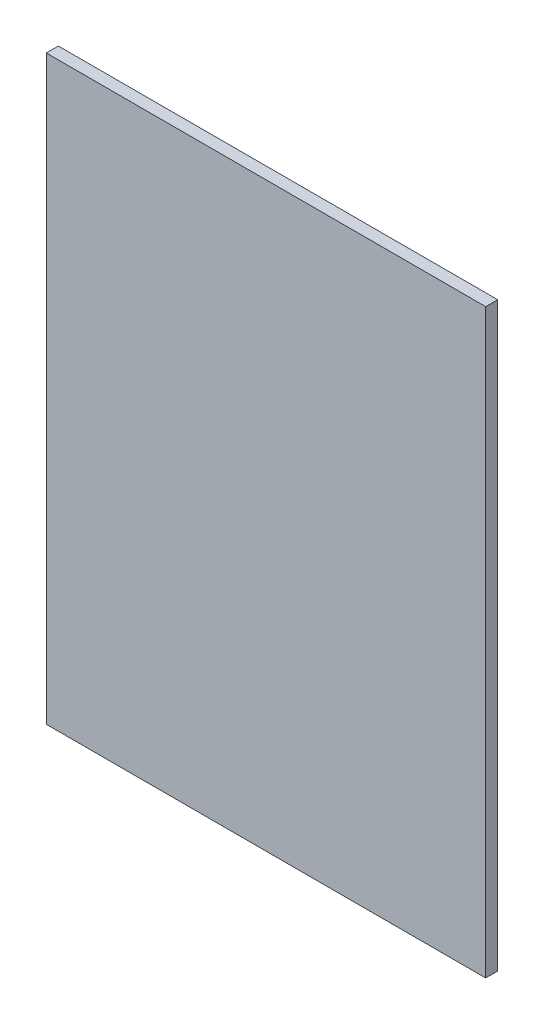
ISO-10303-21;
HEADER;
FILE_DESCRIPTION(('STEP AP214'),'2;1');
FILE_NAME('part.step','',(''),(''),'','','');
FILE_SCHEMA(('AUTOMOTIVE_DESIGN { 1 0 10303 214 1 1 1 1 }'));
ENDSEC;
DATA;
#1=APPLICATION_CONTEXT('core data for automotive mechanical design processes');
#2=APPLICATION_PROTOCOL_DEFINITION('international standard','automotive_design',2000,#1);
#3=PRODUCT_CONTEXT('',#1,'mechanical');
#4=PRODUCT('Part','Part','',(#3));
#5=PRODUCT_RELATED_PRODUCT_CATEGORY('part','',(#4));
#6=PRODUCT_DEFINITION_FORMATION('','',#4);
#7=PRODUCT_DEFINITION_CONTEXT('part definition',#1,'design');
#8=PRODUCT_DEFINITION('design','',#6,#7);
#9=PRODUCT_DEFINITION_SHAPE('','',#8);
#10=(LENGTH_UNIT() NAMED_UNIT(*) SI_UNIT(.MILLI.,.METRE.));
#11=(NAMED_UNIT(*) PLANE_ANGLE_UNIT() SI_UNIT($,.RADIAN.));
#12=(NAMED_UNIT(*) SI_UNIT($,.STERADIAN.) SOLID_ANGLE_UNIT());
#13=UNCERTAINTY_MEASURE_WITH_UNIT(LENGTH_MEASURE(1.E-05),#10,'distance_accuracy_value','');
#14=(GEOMETRIC_REPRESENTATION_CONTEXT(3) GLOBAL_UNCERTAINTY_ASSIGNED_CONTEXT((#13)) GLOBAL_UNIT_ASSIGNED_CONTEXT((#10,
#11,#12)) REPRESENTATION_CONTEXT('',''));
#15=CARTESIAN_POINT('',(0.,0.,0.));
#16=DIRECTION('',(0.,0.,1.));
#17=DIRECTION('',(1.,0.,0.));
#18=AXIS2_PLACEMENT_3D('',#15,#16,#17);
#19=CARTESIAN_POINT('',(0.,0.,3.));
#20=DIRECTION('',(1.,0.,0.));
#21=DIRECTION('',(0.,0.,-1.));
#22=AXIS2_PLACEMENT_3D('',#19,#20,#21);
#23=PLANE('',#22);
#24=DIRECTION('',(0.,-1.,0.));
#25=VECTOR('',#24,1.);
#26=CARTESIAN_POINT('',(0.,0.,0.));
#27=LINE('',#26,#25);
#28=CARTESIAN_POINT('',(0.,0.,0.));
#29=VERTEX_POINT('',#28);
#30=CARTESIAN_POINT('',(0.,-145.,0.));
#31=VERTEX_POINT('',#30);
#32=EDGE_CURVE('E107',#29,#31,#27,.T.);
#33=ORIENTED_EDGE('',*,*,#32,.T.);
#34=DIRECTION('',(0.,0.,-1.));
#35=VECTOR('',#34,1.);
#36=CARTESIAN_POINT('',(0.,-145.,3.));
#37=LINE('',#36,#35);
#38=CARTESIAN_POINT('',(0.,-145.,3.));
#39=VERTEX_POINT('',#38);
#40=EDGE_CURVE('E11',#39,#31,#37,.T.);
#41=ORIENTED_EDGE('',*,*,#40,.F.);
#42=DIRECTION('',(0.,-1.,0.));
#43=VECTOR('',#42,1.);
#44=CARTESIAN_POINT('',(0.,0.,3.));
#45=LINE('',#44,#43);
#46=CARTESIAN_POINT('',(0.,0.,3.));
#47=VERTEX_POINT('',#46);
#48=EDGE_CURVE('E91',#47,#39,#45,.T.);
#49=ORIENTED_EDGE('',*,*,#48,.F.);
#50=DIRECTION('',(0.,0.,-1.));
#51=VECTOR('',#50,1.);
#52=CARTESIAN_POINT('',(0.,0.,3.));
#53=LINE('',#52,#51);
#54=EDGE_CURVE('E103',#47,#29,#53,.T.);
#55=ORIENTED_EDGE('',*,*,#54,.T.);
#56=EDGE_LOOP('',(#33,#41,#49,#55));
#57=FACE_BOUND('',#56,.T.);
#58=ADVANCED_FACE('F39',(#57),#23,.F.);
#59=CARTESIAN_POINT('',(0.,-145.,3.));
#60=DIRECTION('',(0.,1.,0.));
#61=DIRECTION('',(0.,0.,1.));
#62=AXIS2_PLACEMENT_3D('',#59,#60,#61);
#63=PLANE('',#62);
#64=DIRECTION('',(1.,0.,0.));
#65=VECTOR('',#64,1.);
#66=CARTESIAN_POINT('',(0.,-145.,0.));
#67=LINE('',#66,#65);
#68=CARTESIAN_POINT('',(109.6,-145.,0.));
#69=VERTEX_POINT('',#68);
#70=EDGE_CURVE('E96',#31,#69,#67,.T.);
#71=ORIENTED_EDGE('',*,*,#70,.T.);
#72=DIRECTION('',(0.,0.,-1.));
#73=VECTOR('',#72,1.);
#74=CARTESIAN_POINT('',(109.6,-145.,3.));
#75=LINE('',#74,#73);
#76=CARTESIAN_POINT('',(109.6,-145.,3.));
#77=VERTEX_POINT('',#76);
#78=EDGE_CURVE('E48',#77,#69,#75,.T.);
#79=ORIENTED_EDGE('',*,*,#78,.F.);
#80=DIRECTION('',(1.,0.,0.));
#81=VECTOR('',#80,1.);
#82=CARTESIAN_POINT('',(0.,-145.,3.));
#83=LINE('',#82,#81);
#84=EDGE_CURVE('E86',#39,#77,#83,.T.);
#85=ORIENTED_EDGE('',*,*,#84,.F.);
#86=ORIENTED_EDGE('',*,*,#40,.T.);
#87=EDGE_LOOP('',(#71,#79,#85,#86));
#88=FACE_BOUND('',#87,.T.);
#89=ADVANCED_FACE('F95',(#88),#63,.F.);
#90=CARTESIAN_POINT('',(109.6,0.,3.));
#91=DIRECTION('',(-1.,0.,0.));
#92=DIRECTION('',(0.,-1.,0.));
#93=AXIS2_PLACEMENT_3D('',#90,#91,#92);
#94=PLANE('',#93);
#95=DIRECTION('',(0.,1.,0.));
#96=VECTOR('',#95,1.);
#97=CARTESIAN_POINT('',(109.6,0.,0.));
#98=LINE('',#97,#96);
#99=CARTESIAN_POINT('',(109.6,0.,0.));
#100=VERTEX_POINT('',#99);
#101=EDGE_CURVE('E73',#69,#100,#98,.T.);
#102=ORIENTED_EDGE('',*,*,#101,.T.);
#103=DIRECTION('',(0.,0.,-1.));
#104=VECTOR('',#103,1.);
#105=CARTESIAN_POINT('',(109.6,0.,3.));
#106=LINE('',#105,#104);
#107=CARTESIAN_POINT('',(109.6,0.,3.));
#108=VERTEX_POINT('',#107);
#109=EDGE_CURVE('E98',#108,#100,#106,.T.);
#110=ORIENTED_EDGE('',*,*,#109,.F.);
#111=DIRECTION('',(0.,1.,0.));
#112=VECTOR('',#111,1.);
#113=CARTESIAN_POINT('',(109.6,0.,3.));
#114=LINE('',#113,#112);
#115=EDGE_CURVE('E89',#77,#108,#114,.T.);
#116=ORIENTED_EDGE('',*,*,#115,.F.);
#117=ORIENTED_EDGE('',*,*,#78,.T.);
#118=EDGE_LOOP('',(#102,#110,#116,#117));
#119=FACE_BOUND('',#118,.T.);
#120=ADVANCED_FACE('F99',(#119),#94,.F.);
#121=CARTESIAN_POINT('',(0.,0.,3.));
#122=DIRECTION('',(0.,-1.,0.));
#123=DIRECTION('',(0.,0.,-1.));
#124=AXIS2_PLACEMENT_3D('',#121,#122,#123);
#125=PLANE('',#124);
#126=DIRECTION('',(-1.,0.,0.));
#127=VECTOR('',#126,1.);
#128=CARTESIAN_POINT('',(0.,0.,0.));
#129=LINE('',#128,#127);
#130=EDGE_CURVE('E79',#100,#29,#129,.T.);
#131=ORIENTED_EDGE('',*,*,#130,.T.);
#132=ORIENTED_EDGE('',*,*,#54,.F.);
#133=DIRECTION('',(-1.,0.,0.));
#134=VECTOR('',#133,1.);
#135=CARTESIAN_POINT('',(0.,0.,3.));
#136=LINE('',#135,#134);
#137=EDGE_CURVE('E56',#108,#47,#136,.T.);
#138=ORIENTED_EDGE('',*,*,#137,.F.);
#139=ORIENTED_EDGE('',*,*,#109,.T.);
#140=EDGE_LOOP('',(#131,#132,#138,#139));
#141=FACE_BOUND('',#140,.T.);
#142=ADVANCED_FACE('F120',(#141),#125,.F.);
#143=CARTESIAN_POINT('',(0.,0.,3.));
#144=DIRECTION('',(0.,0.,1.));
#145=DIRECTION('',(1.,0.,0.));
#146=AXIS2_PLACEMENT_3D('',#143,#144,#145);
#147=PLANE('',#146);
#148=ORIENTED_EDGE('',*,*,#48,.T.);
#149=ORIENTED_EDGE('',*,*,#84,.T.);
#150=ORIENTED_EDGE('',*,*,#115,.T.);
#151=ORIENTED_EDGE('',*,*,#137,.T.);
#152=EDGE_LOOP('',(#148,#149,#150,#151));
#153=FACE_BOUND('',#152,.T.);
#154=ADVANCED_FACE('F87',(#153),#147,.T.);
#155=CARTESIAN_POINT('',(0.,0.,0.));
#156=DIRECTION('',(0.,0.,1.));
#157=DIRECTION('',(1.,0.,0.));
#158=AXIS2_PLACEMENT_3D('',#155,#156,#157);
#159=PLANE('',#158);
#160=ORIENTED_EDGE('',*,*,#32,.F.);
#161=ORIENTED_EDGE('',*,*,#130,.F.);
#162=ORIENTED_EDGE('',*,*,#101,.F.);
#163=ORIENTED_EDGE('',*,*,#70,.F.);
#164=EDGE_LOOP('',(#160,#161,#162,#163));
#165=FACE_BOUND('',#164,.T.);
#166=ADVANCED_FACE('F123',(#165),#159,.F.);
#167=CLOSED_SHELL('',(#58,#89,#120,#142,#154,#166));
#168=MANIFOLD_SOLID_BREP('B2',#167);
#169=ADVANCED_BREP_SHAPE_REPRESENTATION('',(#18,#168),#14);
#170=SHAPE_DEFINITION_REPRESENTATION(#9,#169);
ENDSEC;
END-ISO-10303-21;
